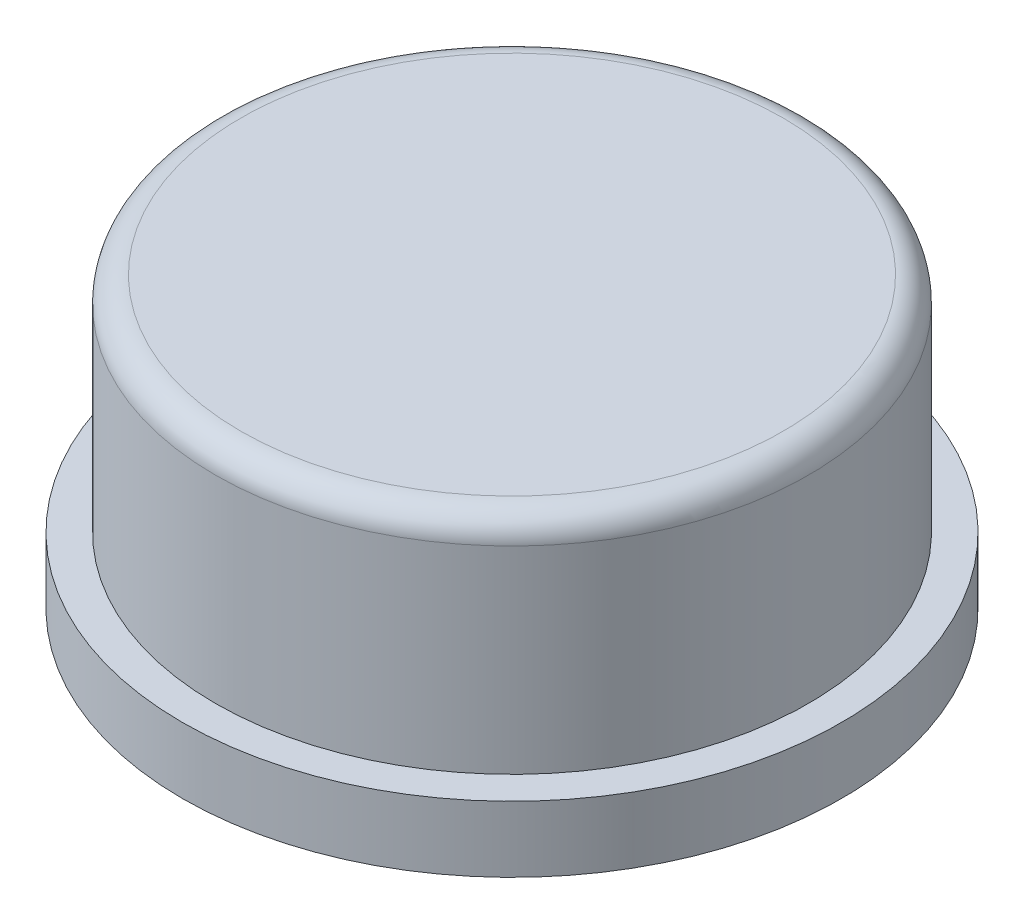
ISO-10303-21;
HEADER;
FILE_DESCRIPTION(('STEP AP214'),'2;1');
FILE_NAME('part.step','',(''),(''),'','','');
FILE_SCHEMA(('AUTOMOTIVE_DESIGN { 1 0 10303 214 1 1 1 1 }'));
ENDSEC;
DATA;
#1=APPLICATION_CONTEXT('core data for automotive mechanical design processes');
#2=APPLICATION_PROTOCOL_DEFINITION('international standard','automotive_design',2000,#1);
#3=PRODUCT_CONTEXT('',#1,'mechanical');
#4=PRODUCT('Part','Part','',(#3));
#5=PRODUCT_RELATED_PRODUCT_CATEGORY('part','',(#4));
#6=PRODUCT_DEFINITION_FORMATION('','',#4);
#7=PRODUCT_DEFINITION_CONTEXT('part definition',#1,'design');
#8=PRODUCT_DEFINITION('design','',#6,#7);
#9=PRODUCT_DEFINITION_SHAPE('','',#8);
#10=(LENGTH_UNIT() NAMED_UNIT(*) SI_UNIT(.MILLI.,.METRE.));
#11=(NAMED_UNIT(*) PLANE_ANGLE_UNIT() SI_UNIT($,.RADIAN.));
#12=(NAMED_UNIT(*) SI_UNIT($,.STERADIAN.) SOLID_ANGLE_UNIT());
#13=UNCERTAINTY_MEASURE_WITH_UNIT(LENGTH_MEASURE(1.E-05),#10,'distance_accuracy_value','');
#14=(GEOMETRIC_REPRESENTATION_CONTEXT(3) GLOBAL_UNCERTAINTY_ASSIGNED_CONTEXT((#13)) GLOBAL_UNIT_ASSIGNED_CONTEXT((#10,
#11,#12)) REPRESENTATION_CONTEXT('',''));
#15=CARTESIAN_POINT('',(0.,0.,0.));
#16=DIRECTION('',(0.,0.,1.));
#17=DIRECTION('',(1.,0.,0.));
#18=AXIS2_PLACEMENT_3D('',#15,#16,#17);
#19=CARTESIAN_POINT('',(0.,0.,0.));
#20=DIRECTION('',(0.,1.,0.));
#21=DIRECTION('',(0.,0.,1.));
#22=AXIS2_PLACEMENT_3D('',#19,#20,#21);
#23=PLANE('',#22);
#24=CARTESIAN_POINT('',(0.,0.,0.));
#25=DIRECTION('',(0.,1.,0.));
#26=DIRECTION('',(0.,0.,1.));
#27=AXIS2_PLACEMENT_3D('',#24,#25,#26);
#28=CIRCLE('',#27,6.5);
#29=CARTESIAN_POINT('',(0.,0.,6.5));
#30=VERTEX_POINT('',#29);
#31=EDGE_CURVE('E172',#30,#30,#28,.T.);
#32=ORIENTED_EDGE('',*,*,#31,.F.);
#33=EDGE_LOOP('',(#32));
#34=FACE_BOUND('',#33,.T.);
#35=DIRECTION('',(0.,0.,1.));
#36=VECTOR('',#35,1.);
#37=CARTESIAN_POINT('',(2.,0.,2.));
#38=LINE('',#37,#36);
#39=CARTESIAN_POINT('',(2.,0.,-2.));
#40=VERTEX_POINT('',#39);
#41=CARTESIAN_POINT('',(2.,0.,2.));
#42=VERTEX_POINT('',#41);
#43=EDGE_CURVE('E62',#40,#42,#38,.T.);
#44=ORIENTED_EDGE('',*,*,#43,.F.);
#45=DIRECTION('',(1.,0.,0.));
#46=VECTOR('',#45,1.);
#47=CARTESIAN_POINT('',(-2.,0.,-2.));
#48=LINE('',#47,#46);
#49=CARTESIAN_POINT('',(-2.,0.,-2.));
#50=VERTEX_POINT('',#49);
#51=EDGE_CURVE('E146',#50,#40,#48,.T.);
#52=ORIENTED_EDGE('',*,*,#51,.F.);
#53=DIRECTION('',(0.,0.,-1.));
#54=VECTOR('',#53,1.);
#55=CARTESIAN_POINT('',(-2.,0.,2.));
#56=LINE('',#55,#54);
#57=CARTESIAN_POINT('',(-2.,0.,2.));
#58=VERTEX_POINT('',#57);
#59=EDGE_CURVE('E157',#58,#50,#56,.T.);
#60=ORIENTED_EDGE('',*,*,#59,.F.);
#61=DIRECTION('',(-1.,0.,0.));
#62=VECTOR('',#61,1.);
#63=CARTESIAN_POINT('',(-2.,0.,2.));
#64=LINE('',#63,#62);
#65=EDGE_CURVE('E154',#42,#58,#64,.T.);
#66=ORIENTED_EDGE('',*,*,#65,.F.);
#67=EDGE_LOOP('',(#44,#52,#60,#66));
#68=FACE_BOUND('',#67,.T.);
#69=ADVANCED_FACE('F39',(#34,#68),#23,.F.);
#70=CARTESIAN_POINT('',(0.,1.3,0.));
#71=DIRECTION('',(0.,-1.,0.));
#72=DIRECTION('',(0.,0.,-1.));
#73=AXIS2_PLACEMENT_3D('',#70,#71,#72);
#74=CYLINDRICAL_SURFACE('',#73,6.5);
#75=CARTESIAN_POINT('',(0.,1.3,0.));
#76=DIRECTION('',(0.,1.,0.));
#77=DIRECTION('',(0.,0.,1.));
#78=AXIS2_PLACEMENT_3D('',#75,#76,#77);
#79=CIRCLE('',#78,6.5);
#80=CARTESIAN_POINT('',(0.,1.3,6.5));
#81=VERTEX_POINT('',#80);
#82=EDGE_CURVE('E176',#81,#81,#79,.T.);
#83=ORIENTED_EDGE('',*,*,#82,.F.);
#84=EDGE_LOOP('',(#83));
#85=FACE_BOUND('',#84,.T.);
#86=ORIENTED_EDGE('',*,*,#31,.T.);
#87=EDGE_LOOP('',(#86));
#88=FACE_BOUND('',#87,.T.);
#89=ADVANCED_FACE('F199',(#85,#88),#74,.T.);
#90=CARTESIAN_POINT('',(0.,1.3,0.));
#91=DIRECTION('',(0.,1.,0.));
#92=DIRECTION('',(0.,0.,1.));
#93=AXIS2_PLACEMENT_3D('',#90,#91,#92);
#94=PLANE('',#93);
#95=CARTESIAN_POINT('',(0.,1.3,0.));
#96=DIRECTION('',(0.,1.,0.));
#97=DIRECTION('',(0.,0.,1.));
#98=AXIS2_PLACEMENT_3D('',#95,#96,#97);
#99=CIRCLE('',#98,5.85);
#100=CARTESIAN_POINT('',(0.,1.3,5.85));
#101=VERTEX_POINT('',#100);
#102=EDGE_CURVE('E173',#101,#101,#99,.T.);
#103=ORIENTED_EDGE('',*,*,#102,.F.);
#104=EDGE_LOOP('',(#103));
#105=FACE_BOUND('',#104,.T.);
#106=ORIENTED_EDGE('',*,*,#82,.T.);
#107=EDGE_LOOP('',(#106));
#108=FACE_BOUND('',#107,.T.);
#109=ADVANCED_FACE('F205',(#105,#108),#94,.T.);
#110=CARTESIAN_POINT('',(0.,5.7,0.));
#111=DIRECTION('',(0.,-1.,0.));
#112=DIRECTION('',(0.,0.,-1.));
#113=AXIS2_PLACEMENT_3D('',#110,#111,#112);
#114=CYLINDRICAL_SURFACE('',#113,5.85);
#115=CARTESIAN_POINT('',(0.,5.2,0.));
#116=DIRECTION('',(0.,1.,0.));
#117=DIRECTION('',(0.,0.,1.));
#118=AXIS2_PLACEMENT_3D('',#115,#116,#117);
#119=CIRCLE('',#118,5.85);
#120=CARTESIAN_POINT('',(0.,5.2,5.85));
#121=VERTEX_POINT('',#120);
#122=EDGE_CURVE('E11',#121,#121,#119,.F.);
#123=ORIENTED_EDGE('',*,*,#122,.T.);
#124=EDGE_LOOP('',(#123));
#125=FACE_BOUND('',#124,.T.);
#126=ORIENTED_EDGE('',*,*,#102,.T.);
#127=EDGE_LOOP('',(#126));
#128=FACE_BOUND('',#127,.T.);
#129=ADVANCED_FACE('F195',(#125,#128),#114,.T.);
#130=CARTESIAN_POINT('',(0.,5.7,0.));
#131=DIRECTION('',(0.,1.,0.));
#132=DIRECTION('',(0.,0.,1.));
#133=AXIS2_PLACEMENT_3D('',#130,#131,#132);
#134=PLANE('',#133);
#135=CARTESIAN_POINT('',(0.,5.7,0.));
#136=DIRECTION('',(0.,1.,0.));
#137=DIRECTION('',(0.,0.,1.));
#138=AXIS2_PLACEMENT_3D('',#135,#136,#137);
#139=CIRCLE('',#138,5.35);
#140=CARTESIAN_POINT('',(0.,5.7,5.35));
#141=VERTEX_POINT('',#140);
#142=EDGE_CURVE('E47',#141,#141,#139,.T.);
#143=ORIENTED_EDGE('',*,*,#142,.T.);
#144=EDGE_LOOP('',(#143));
#145=FACE_BOUND('',#144,.T.);
#146=ADVANCED_FACE('F183',(#145),#134,.T.);
#147=CARTESIAN_POINT('',(0.,5.2,0.));
#148=DIRECTION('',(0.,1.,0.));
#149=DIRECTION('',(0.,0.,1.));
#150=AXIS2_PLACEMENT_3D('',#147,#148,#149);
#151=TOROIDAL_SURFACE('',#150,5.35,0.5);
#152=ORIENTED_EDGE('',*,*,#122,.F.);
#153=EDGE_LOOP('',(#152));
#154=FACE_BOUND('',#153,.T.);
#155=ORIENTED_EDGE('',*,*,#142,.F.);
#156=EDGE_LOOP('',(#155));
#157=FACE_BOUND('',#156,.T.);
#158=ADVANCED_FACE('F41',(#154,#157),#151,.T.);
#159=CARTESIAN_POINT('',(2.,-2.,2.));
#160=DIRECTION('',(-1.,0.,0.));
#161=DIRECTION('',(0.,0.,1.));
#162=AXIS2_PLACEMENT_3D('',#159,#160,#161);
#163=PLANE('',#162);
#164=ORIENTED_EDGE('',*,*,#43,.T.);
#165=DIRECTION('',(0.,1.,0.));
#166=VECTOR('',#165,1.);
#167=CARTESIAN_POINT('',(2.,-2.,2.));
#168=LINE('',#167,#166);
#169=CARTESIAN_POINT('',(2.,-2.,2.));
#170=VERTEX_POINT('',#169);
#171=EDGE_CURVE('E169',#170,#42,#168,.T.);
#172=ORIENTED_EDGE('',*,*,#171,.F.);
#173=DIRECTION('',(0.,0.,1.));
#174=VECTOR('',#173,1.);
#175=CARTESIAN_POINT('',(2.,-2.,2.));
#176=LINE('',#175,#174);
#177=CARTESIAN_POINT('',(2.,-2.,-2.));
#178=VERTEX_POINT('',#177);
#179=EDGE_CURVE('E142',#178,#170,#176,.T.);
#180=ORIENTED_EDGE('',*,*,#179,.F.);
#181=DIRECTION('',(0.,1.,0.));
#182=VECTOR('',#181,1.);
#183=CARTESIAN_POINT('',(2.,-2.,-2.));
#184=LINE('',#183,#182);
#185=EDGE_CURVE('E152',#178,#40,#184,.T.);
#186=ORIENTED_EDGE('',*,*,#185,.T.);
#187=EDGE_LOOP('',(#164,#172,#180,#186));
#188=FACE_BOUND('',#187,.T.);
#189=ADVANCED_FACE('F186',(#188),#163,.F.);
#190=CARTESIAN_POINT('',(-2.,-2.,2.));
#191=DIRECTION('',(0.,0.,-1.));
#192=DIRECTION('',(-1.,0.,0.));
#193=AXIS2_PLACEMENT_3D('',#190,#191,#192);
#194=PLANE('',#193);
#195=ORIENTED_EDGE('',*,*,#65,.T.);
#196=DIRECTION('',(0.,1.,0.));
#197=VECTOR('',#196,1.);
#198=CARTESIAN_POINT('',(-2.,-2.,2.));
#199=LINE('',#198,#197);
#200=CARTESIAN_POINT('',(-2.,-2.,2.));
#201=VERTEX_POINT('',#200);
#202=EDGE_CURVE('E166',#201,#58,#199,.T.);
#203=ORIENTED_EDGE('',*,*,#202,.F.);
#204=DIRECTION('',(-1.,0.,0.));
#205=VECTOR('',#204,1.);
#206=CARTESIAN_POINT('',(-2.,-2.,2.));
#207=LINE('',#206,#205);
#208=EDGE_CURVE('E145',#170,#201,#207,.T.);
#209=ORIENTED_EDGE('',*,*,#208,.F.);
#210=ORIENTED_EDGE('',*,*,#171,.T.);
#211=EDGE_LOOP('',(#195,#203,#209,#210));
#212=FACE_BOUND('',#211,.T.);
#213=ADVANCED_FACE('F192',(#212),#194,.F.);
#214=CARTESIAN_POINT('',(-2.,-2.,2.));
#215=DIRECTION('',(1.,0.,0.));
#216=DIRECTION('',(0.,0.,-1.));
#217=AXIS2_PLACEMENT_3D('',#214,#215,#216);
#218=PLANE('',#217);
#219=ORIENTED_EDGE('',*,*,#59,.T.);
#220=DIRECTION('',(0.,1.,0.));
#221=VECTOR('',#220,1.);
#222=CARTESIAN_POINT('',(-2.,-2.,-2.));
#223=LINE('',#222,#221);
#224=CARTESIAN_POINT('',(-2.,-2.,-2.));
#225=VERTEX_POINT('',#224);
#226=EDGE_CURVE('E163',#225,#50,#223,.T.);
#227=ORIENTED_EDGE('',*,*,#226,.F.);
#228=DIRECTION('',(0.,0.,-1.));
#229=VECTOR('',#228,1.);
#230=CARTESIAN_POINT('',(-2.,-2.,2.));
#231=LINE('',#230,#229);
#232=EDGE_CURVE('E148',#201,#225,#231,.T.);
#233=ORIENTED_EDGE('',*,*,#232,.F.);
#234=ORIENTED_EDGE('',*,*,#202,.T.);
#235=EDGE_LOOP('',(#219,#227,#233,#234));
#236=FACE_BOUND('',#235,.T.);
#237=ADVANCED_FACE('F217',(#236),#218,.F.);
#238=CARTESIAN_POINT('',(-2.,-2.,-2.));
#239=DIRECTION('',(0.,0.,1.));
#240=DIRECTION('',(1.,0.,0.));
#241=AXIS2_PLACEMENT_3D('',#238,#239,#240);
#242=PLANE('',#241);
#243=ORIENTED_EDGE('',*,*,#51,.T.);
#244=ORIENTED_EDGE('',*,*,#185,.F.);
#245=DIRECTION('',(1.,0.,0.));
#246=VECTOR('',#245,1.);
#247=CARTESIAN_POINT('',(-2.,-2.,-2.));
#248=LINE('',#247,#246);
#249=EDGE_CURVE('E150',#225,#178,#248,.T.);
#250=ORIENTED_EDGE('',*,*,#249,.F.);
#251=ORIENTED_EDGE('',*,*,#226,.T.);
#252=EDGE_LOOP('',(#243,#244,#250,#251));
#253=FACE_BOUND('',#252,.T.);
#254=ADVANCED_FACE('F221',(#253),#242,.F.);
#255=CARTESIAN_POINT('',(0.,-2.,0.));
#256=DIRECTION('',(0.,-1.,0.));
#257=DIRECTION('',(0.,0.,-1.));
#258=AXIS2_PLACEMENT_3D('',#255,#256,#257);
#259=PLANE('',#258);
#260=DIRECTION('',(0.,0.,1.));
#261=VECTOR('',#260,1.);
#262=CARTESIAN_POINT('',(1.9,-2.,1.9));
#263=LINE('',#262,#261);
#264=CARTESIAN_POINT('',(1.9,-2.,-1.9));
#265=VERTEX_POINT('',#264);
#266=CARTESIAN_POINT('',(1.9,-2.,1.9));
#267=VERTEX_POINT('',#266);
#268=EDGE_CURVE('E54',#265,#267,#263,.T.);
#269=ORIENTED_EDGE('',*,*,#268,.F.);
#270=DIRECTION('',(1.,0.,0.));
#271=VECTOR('',#270,1.);
#272=CARTESIAN_POINT('',(-1.9,-2.,-1.9));
#273=LINE('',#272,#271);
#274=CARTESIAN_POINT('',(-1.9,-2.,-1.9));
#275=VERTEX_POINT('',#274);
#276=EDGE_CURVE('E124',#275,#265,#273,.T.);
#277=ORIENTED_EDGE('',*,*,#276,.F.);
#278=DIRECTION('',(0.,0.,-1.));
#279=VECTOR('',#278,1.);
#280=CARTESIAN_POINT('',(-1.9,-2.,1.9));
#281=LINE('',#280,#279);
#282=CARTESIAN_POINT('',(-1.9,-2.,1.9));
#283=VERTEX_POINT('',#282);
#284=EDGE_CURVE('E127',#283,#275,#281,.T.);
#285=ORIENTED_EDGE('',*,*,#284,.F.);
#286=DIRECTION('',(-1.,0.,0.));
#287=VECTOR('',#286,1.);
#288=CARTESIAN_POINT('',(-1.9,-2.,1.9));
#289=LINE('',#288,#287);
#290=EDGE_CURVE('E133',#267,#283,#289,.T.);
#291=ORIENTED_EDGE('',*,*,#290,.F.);
#292=EDGE_LOOP('',(#269,#277,#285,#291));
#293=FACE_BOUND('',#292,.T.);
#294=ORIENTED_EDGE('',*,*,#179,.T.);
#295=ORIENTED_EDGE('',*,*,#208,.T.);
#296=ORIENTED_EDGE('',*,*,#232,.T.);
#297=ORIENTED_EDGE('',*,*,#249,.T.);
#298=EDGE_LOOP('',(#294,#295,#296,#297));
#299=FACE_BOUND('',#298,.T.);
#300=ADVANCED_FACE('F225',(#293,#299),#259,.T.);
#301=CARTESIAN_POINT('',(1.9,0.,1.9));
#302=DIRECTION('',(1.,0.,0.));
#303=DIRECTION('',(0.,0.,-1.));
#304=AXIS2_PLACEMENT_3D('',#301,#302,#303);
#305=PLANE('',#304);
#306=ORIENTED_EDGE('',*,*,#268,.T.);
#307=DIRECTION('',(0.,-1.,0.));
#308=VECTOR('',#307,1.);
#309=CARTESIAN_POINT('',(1.9,0.,1.9));
#310=LINE('',#309,#308);
#311=CARTESIAN_POINT('',(1.9,0.,1.9));
#312=VERTEX_POINT('',#311);
#313=EDGE_CURVE('E102',#312,#267,#310,.T.);
#314=ORIENTED_EDGE('',*,*,#313,.F.);
#315=DIRECTION('',(0.,0.,1.));
#316=VECTOR('',#315,1.);
#317=CARTESIAN_POINT('',(1.9,0.,1.9));
#318=LINE('',#317,#316);
#319=CARTESIAN_POINT('',(1.9,0.,-1.9));
#320=VERTEX_POINT('',#319);
#321=EDGE_CURVE('E106',#320,#312,#318,.T.);
#322=ORIENTED_EDGE('',*,*,#321,.F.);
#323=DIRECTION('',(0.,-1.,0.));
#324=VECTOR('',#323,1.);
#325=CARTESIAN_POINT('',(1.9,0.,-1.9));
#326=LINE('',#325,#324);
#327=EDGE_CURVE('E137',#320,#265,#326,.T.);
#328=ORIENTED_EDGE('',*,*,#327,.T.);
#329=EDGE_LOOP('',(#306,#314,#322,#328));
#330=FACE_BOUND('',#329,.T.);
#331=ADVANCED_FACE('F104',(#330),#305,.F.);
#332=CARTESIAN_POINT('',(-1.9,0.,-1.9));
#333=DIRECTION('',(0.,0.,-1.));
#334=DIRECTION('',(-1.,0.,0.));
#335=AXIS2_PLACEMENT_3D('',#332,#333,#334);
#336=PLANE('',#335);
#337=ORIENTED_EDGE('',*,*,#276,.T.);
#338=ORIENTED_EDGE('',*,*,#327,.F.);
#339=DIRECTION('',(1.,0.,0.));
#340=VECTOR('',#339,1.);
#341=CARTESIAN_POINT('',(-1.9,0.,-1.9));
#342=LINE('',#341,#340);
#343=CARTESIAN_POINT('',(-1.9,0.,-1.9));
#344=VERTEX_POINT('',#343);
#345=EDGE_CURVE('E112',#344,#320,#342,.T.);
#346=ORIENTED_EDGE('',*,*,#345,.F.);
#347=DIRECTION('',(0.,-1.,0.));
#348=VECTOR('',#347,1.);
#349=CARTESIAN_POINT('',(-1.9,0.,-1.9));
#350=LINE('',#349,#348);
#351=EDGE_CURVE('E139',#344,#275,#350,.T.);
#352=ORIENTED_EDGE('',*,*,#351,.T.);
#353=EDGE_LOOP('',(#337,#338,#346,#352));
#354=FACE_BOUND('',#353,.T.);
#355=ADVANCED_FACE('F232',(#354),#336,.F.);
#356=CARTESIAN_POINT('',(-1.9,0.,1.9));
#357=DIRECTION('',(-1.,0.,0.));
#358=DIRECTION('',(0.,0.,1.));
#359=AXIS2_PLACEMENT_3D('',#356,#357,#358);
#360=PLANE('',#359);
#361=ORIENTED_EDGE('',*,*,#284,.T.);
#362=ORIENTED_EDGE('',*,*,#351,.F.);
#363=DIRECTION('',(0.,0.,-1.));
#364=VECTOR('',#363,1.);
#365=CARTESIAN_POINT('',(-1.9,0.,1.9));
#366=LINE('',#365,#364);
#367=CARTESIAN_POINT('',(-1.9,0.,1.9));
#368=VERTEX_POINT('',#367);
#369=EDGE_CURVE('E120',#368,#344,#366,.T.);
#370=ORIENTED_EDGE('',*,*,#369,.F.);
#371=DIRECTION('',(0.,-1.,0.));
#372=VECTOR('',#371,1.);
#373=CARTESIAN_POINT('',(-1.9,0.,1.9));
#374=LINE('',#373,#372);
#375=EDGE_CURVE('E111',#368,#283,#374,.T.);
#376=ORIENTED_EDGE('',*,*,#375,.T.);
#377=EDGE_LOOP('',(#361,#362,#370,#376));
#378=FACE_BOUND('',#377,.T.);
#379=ADVANCED_FACE('F235',(#378),#360,.F.);
#380=CARTESIAN_POINT('',(-1.9,0.,1.9));
#381=DIRECTION('',(0.,0.,1.));
#382=DIRECTION('',(1.,0.,0.));
#383=AXIS2_PLACEMENT_3D('',#380,#381,#382);
#384=PLANE('',#383);
#385=ORIENTED_EDGE('',*,*,#290,.T.);
#386=ORIENTED_EDGE('',*,*,#375,.F.);
#387=DIRECTION('',(-1.,0.,0.));
#388=VECTOR('',#387,1.);
#389=CARTESIAN_POINT('',(-1.9,0.,1.9));
#390=LINE('',#389,#388);
#391=EDGE_CURVE('E115',#312,#368,#390,.T.);
#392=ORIENTED_EDGE('',*,*,#391,.F.);
#393=ORIENTED_EDGE('',*,*,#313,.T.);
#394=EDGE_LOOP('',(#385,#386,#392,#393));
#395=FACE_BOUND('',#394,.T.);
#396=ADVANCED_FACE('F116',(#395),#384,.F.);
#397=CARTESIAN_POINT('',(0.,0.,0.));
#398=DIRECTION('',(0.,-1.,0.));
#399=DIRECTION('',(0.,0.,-1.));
#400=AXIS2_PLACEMENT_3D('',#397,#398,#399);
#401=PLANE('',#400);
#402=ORIENTED_EDGE('',*,*,#321,.T.);
#403=ORIENTED_EDGE('',*,*,#391,.T.);
#404=ORIENTED_EDGE('',*,*,#369,.T.);
#405=ORIENTED_EDGE('',*,*,#345,.T.);
#406=EDGE_LOOP('',(#402,#403,#404,#405));
#407=FACE_BOUND('',#406,.T.);
#408=ADVANCED_FACE('F122',(#407),#401,.T.);
#409=CLOSED_SHELL('',(#69,#89,#109,#129,#146,#158,#189,#213,#237,#254,#300,#331,#355,#379,#396,#408));
#410=MANIFOLD_SOLID_BREP('B2',#409);
#411=ADVANCED_BREP_SHAPE_REPRESENTATION('',(#18,#410),#14);
#412=SHAPE_DEFINITION_REPRESENTATION(#9,#411);
ENDSEC;
END-ISO-10303-21;
